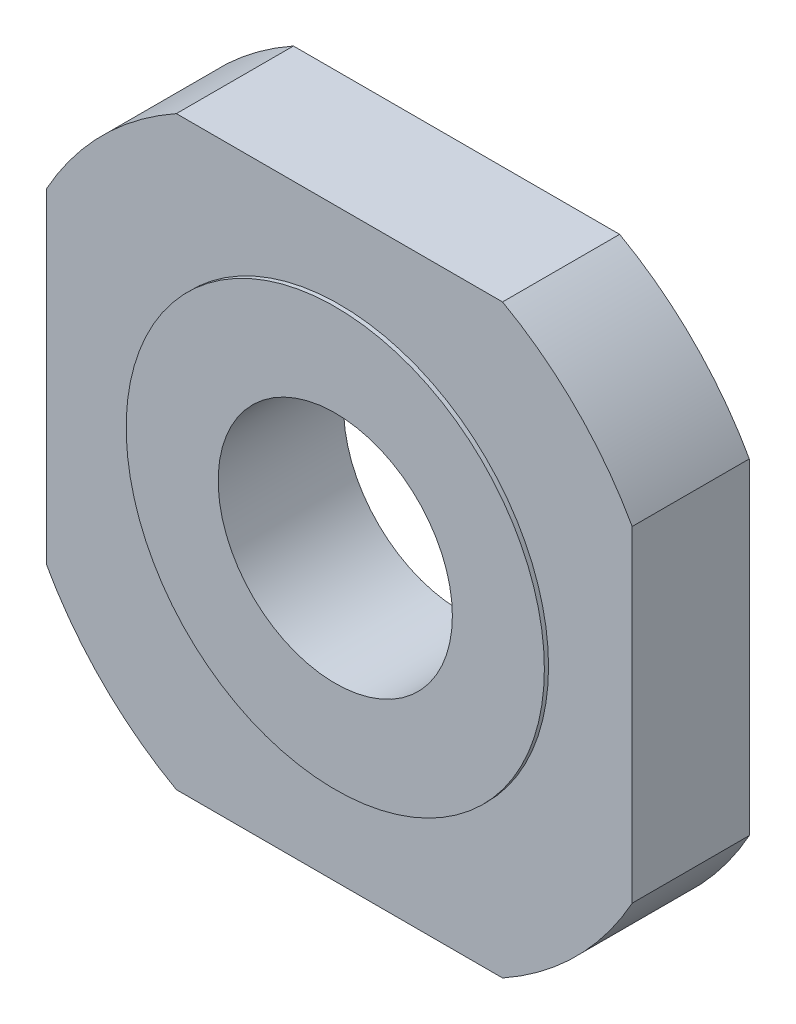
ISO-10303-21;
HEADER;
FILE_DESCRIPTION(('STEP AP214'),'2;1');
FILE_NAME('part.step','',(''),(''),'','','');
FILE_SCHEMA(('AUTOMOTIVE_DESIGN { 1 0 10303 214 1 1 1 1 }'));
ENDSEC;
DATA;
#1=APPLICATION_CONTEXT('core data for automotive mechanical design processes');
#2=APPLICATION_PROTOCOL_DEFINITION('international standard','automotive_design',2000,#1);
#3=PRODUCT_CONTEXT('',#1,'mechanical');
#4=PRODUCT('Part','Part','',(#3));
#5=PRODUCT_RELATED_PRODUCT_CATEGORY('part','',(#4));
#6=PRODUCT_DEFINITION_FORMATION('','',#4);
#7=PRODUCT_DEFINITION_CONTEXT('part definition',#1,'design');
#8=PRODUCT_DEFINITION('design','',#6,#7);
#9=PRODUCT_DEFINITION_SHAPE('','',#8);
#10=(LENGTH_UNIT() NAMED_UNIT(*) SI_UNIT(.MILLI.,.METRE.));
#11=(NAMED_UNIT(*) PLANE_ANGLE_UNIT() SI_UNIT($,.RADIAN.));
#12=(NAMED_UNIT(*) SI_UNIT($,.STERADIAN.) SOLID_ANGLE_UNIT());
#13=UNCERTAINTY_MEASURE_WITH_UNIT(LENGTH_MEASURE(1.E-05),#10,'distance_accuracy_value','');
#14=(GEOMETRIC_REPRESENTATION_CONTEXT(3) GLOBAL_UNCERTAINTY_ASSIGNED_CONTEXT((#13)) GLOBAL_UNIT_ASSIGNED_CONTEXT((#10,
#11,#12)) REPRESENTATION_CONTEXT('',''));
#15=CARTESIAN_POINT('',(0.,0.,0.));
#16=DIRECTION('',(0.,0.,1.));
#17=DIRECTION('',(1.,0.,0.));
#18=AXIS2_PLACEMENT_3D('',#15,#16,#17);
#19=CARTESIAN_POINT('',(-0.048207779633342,0.0482077796333455,7.));
#20=DIRECTION('',(0.,0.,1.));
#21=DIRECTION('',(1.,0.,0.));
#22=AXIS2_PLACEMENT_3D('',#19,#20,#21);
#23=PLANE('',#22);
#24=CARTESIAN_POINT('',(0.,0.,7.));
#25=DIRECTION('',(0.,0.,1.));
#26=DIRECTION('',(1.,0.,0.));
#27=AXIS2_PLACEMENT_3D('',#24,#25,#26);
#28=CIRCLE('',#27,25.);
#29=CARTESIAN_POINT('',(25.,0.,7.));
#30=VERTEX_POINT('',#29);
#31=EDGE_CURVE('E123',#30,#30,#28,.F.);
#32=ORIENTED_EDGE('',*,*,#31,.T.);
#33=EDGE_LOOP('',(#32));
#34=FACE_BOUND('',#33,.T.);
#35=CARTESIAN_POINT('',(-0.048207779633342,0.0482077796333455,7.));
#36=DIRECTION('',(0.,0.,1.));
#37=DIRECTION('',(1.,0.,0.));
#38=AXIS2_PLACEMENT_3D('',#35,#36,#37);
#39=CIRCLE('',#38,40.);
#40=CARTESIAN_POINT('',(-19.5,35.,7.));
#41=VERTEX_POINT('',#40);
#42=CARTESIAN_POINT('',(-35.,19.5,7.));
#43=VERTEX_POINT('',#42);
#44=EDGE_CURVE('E156',#41,#43,#39,.T.);
#45=ORIENTED_EDGE('',*,*,#44,.T.);
#46=DIRECTION('',(0.,-1.,0.));
#47=VECTOR('',#46,1.);
#48=CARTESIAN_POINT('',(-35.,-19.5,7.));
#49=LINE('',#48,#47);
#50=CARTESIAN_POINT('',(-35.,-19.5,7.));
#51=VERTEX_POINT('',#50);
#52=EDGE_CURVE('E182',#43,#51,#49,.T.);
#53=ORIENTED_EDGE('',*,*,#52,.T.);
#54=CARTESIAN_POINT('',(-0.048207779633349,-0.0482077796333559,7.));
#55=DIRECTION('',(0.,0.,1.));
#56=DIRECTION('',(1.,0.,0.));
#57=AXIS2_PLACEMENT_3D('',#54,#55,#56);
#58=CIRCLE('',#57,40.);
#59=CARTESIAN_POINT('',(-19.5,-35.,7.));
#60=VERTEX_POINT('',#59);
#61=EDGE_CURVE('E180',#51,#60,#58,.T.);
#62=ORIENTED_EDGE('',*,*,#61,.T.);
#63=DIRECTION('',(1.,0.,0.));
#64=VECTOR('',#63,1.);
#65=CARTESIAN_POINT('',(19.5,-35.,7.));
#66=LINE('',#65,#64);
#67=CARTESIAN_POINT('',(19.5,-35.,7.));
#68=VERTEX_POINT('',#67);
#69=EDGE_CURVE('E178',#60,#68,#66,.T.);
#70=ORIENTED_EDGE('',*,*,#69,.T.);
#71=CARTESIAN_POINT('',(0.048207779633349,-0.0482077796333559,7.));
#72=DIRECTION('',(0.,0.,1.));
#73=DIRECTION('',(1.,0.,0.));
#74=AXIS2_PLACEMENT_3D('',#71,#72,#73);
#75=CIRCLE('',#74,40.);
#76=CARTESIAN_POINT('',(35.,-19.5,7.));
#77=VERTEX_POINT('',#76);
#78=EDGE_CURVE('E176',#68,#77,#75,.T.);
#79=ORIENTED_EDGE('',*,*,#78,.T.);
#80=DIRECTION('',(0.,1.,0.));
#81=VECTOR('',#80,1.);
#82=CARTESIAN_POINT('',(35.,19.5,7.));
#83=LINE('',#82,#81);
#84=CARTESIAN_POINT('',(35.,19.5,7.));
#85=VERTEX_POINT('',#84);
#86=EDGE_CURVE('E174',#77,#85,#83,.T.);
#87=ORIENTED_EDGE('',*,*,#86,.T.);
#88=CARTESIAN_POINT('',(0.048207779633342,0.0482077796333455,7.));
#89=DIRECTION('',(0.,0.,1.));
#90=DIRECTION('',(-1.,0.,0.));
#91=AXIS2_PLACEMENT_3D('',#88,#89,#90);
#92=CIRCLE('',#91,40.);
#93=CARTESIAN_POINT('',(19.5,35.,7.));
#94=VERTEX_POINT('',#93);
#95=EDGE_CURVE('E172',#85,#94,#92,.T.);
#96=ORIENTED_EDGE('',*,*,#95,.T.);
#97=DIRECTION('',(-1.,0.,0.));
#98=VECTOR('',#97,1.);
#99=CARTESIAN_POINT('',(-19.5,35.,7.));
#100=LINE('',#99,#98);
#101=EDGE_CURVE('E153',#94,#41,#100,.T.);
#102=ORIENTED_EDGE('',*,*,#101,.T.);
#103=EDGE_LOOP('',(#45,#53,#62,#70,#79,#87,#96,#102));
#104=FACE_BOUND('',#103,.T.);
#105=ADVANCED_FACE('F36',(#34,#104),#23,.T.);
#106=CARTESIAN_POINT('',(-0.048207779633342,0.0482077796333455,-7.));
#107=DIRECTION('',(0.,0.,1.));
#108=DIRECTION('',(1.,0.,0.));
#109=AXIS2_PLACEMENT_3D('',#106,#107,#108);
#110=PLANE('',#109);
#111=CARTESIAN_POINT('',(0.,0.,-7.));
#112=DIRECTION('',(0.,0.,1.));
#113=DIRECTION('',(1.,0.,0.));
#114=AXIS2_PLACEMENT_3D('',#111,#112,#113);
#115=CIRCLE('',#114,25.);
#116=CARTESIAN_POINT('',(25.,0.,-7.));
#117=VERTEX_POINT('',#116);
#118=EDGE_CURVE('E11',#117,#117,#115,.F.);
#119=ORIENTED_EDGE('',*,*,#118,.F.);
#120=EDGE_LOOP('',(#119));
#121=FACE_BOUND('',#120,.T.);
#122=CARTESIAN_POINT('',(-0.048207779633342,0.0482077796333455,-7.));
#123=DIRECTION('',(0.,0.,1.));
#124=DIRECTION('',(1.,0.,0.));
#125=AXIS2_PLACEMENT_3D('',#122,#123,#124);
#126=CIRCLE('',#125,40.);
#127=CARTESIAN_POINT('',(-19.5,35.,-7.));
#128=VERTEX_POINT('',#127);
#129=CARTESIAN_POINT('',(-35.,19.5,-7.));
#130=VERTEX_POINT('',#129);
#131=EDGE_CURVE('E117',#128,#130,#126,.T.);
#132=ORIENTED_EDGE('',*,*,#131,.F.);
#133=DIRECTION('',(-1.,0.,0.));
#134=VECTOR('',#133,1.);
#135=CARTESIAN_POINT('',(-19.5,35.,-7.));
#136=LINE('',#135,#134);
#137=CARTESIAN_POINT('',(19.5,35.,-7.));
#138=VERTEX_POINT('',#137);
#139=EDGE_CURVE('E154',#138,#128,#136,.T.);
#140=ORIENTED_EDGE('',*,*,#139,.F.);
#141=CARTESIAN_POINT('',(0.048207779633342,0.0482077796333455,-7.));
#142=DIRECTION('',(0.,0.,1.));
#143=DIRECTION('',(-1.,0.,0.));
#144=AXIS2_PLACEMENT_3D('',#141,#142,#143);
#145=CIRCLE('',#144,40.);
#146=CARTESIAN_POINT('',(35.,19.5,-7.));
#147=VERTEX_POINT('',#146);
#148=EDGE_CURVE('E157',#147,#138,#145,.T.);
#149=ORIENTED_EDGE('',*,*,#148,.F.);
#150=DIRECTION('',(0.,1.,0.));
#151=VECTOR('',#150,1.);
#152=CARTESIAN_POINT('',(35.,19.5,-7.));
#153=LINE('',#152,#151);
#154=CARTESIAN_POINT('',(35.,-19.5,-7.));
#155=VERTEX_POINT('',#154);
#156=EDGE_CURVE('E159',#155,#147,#153,.T.);
#157=ORIENTED_EDGE('',*,*,#156,.F.);
#158=CARTESIAN_POINT('',(0.048207779633349,-0.0482077796333559,-7.));
#159=DIRECTION('',(0.,0.,1.));
#160=DIRECTION('',(1.,0.,0.));
#161=AXIS2_PLACEMENT_3D('',#158,#159,#160);
#162=CIRCLE('',#161,40.);
#163=CARTESIAN_POINT('',(19.5,-35.,-7.));
#164=VERTEX_POINT('',#163);
#165=EDGE_CURVE('E161',#164,#155,#162,.T.);
#166=ORIENTED_EDGE('',*,*,#165,.F.);
#167=DIRECTION('',(1.,0.,0.));
#168=VECTOR('',#167,1.);
#169=CARTESIAN_POINT('',(19.5,-35.,-7.));
#170=LINE('',#169,#168);
#171=CARTESIAN_POINT('',(-19.5,-35.,-7.));
#172=VERTEX_POINT('',#171);
#173=EDGE_CURVE('E163',#172,#164,#170,.T.);
#174=ORIENTED_EDGE('',*,*,#173,.F.);
#175=CARTESIAN_POINT('',(-0.048207779633349,-0.0482077796333559,-7.));
#176=DIRECTION('',(0.,0.,1.));
#177=DIRECTION('',(1.,0.,0.));
#178=AXIS2_PLACEMENT_3D('',#175,#176,#177);
#179=CIRCLE('',#178,40.);
#180=CARTESIAN_POINT('',(-35.,-19.5,-7.));
#181=VERTEX_POINT('',#180);
#182=EDGE_CURVE('E165',#181,#172,#179,.T.);
#183=ORIENTED_EDGE('',*,*,#182,.F.);
#184=DIRECTION('',(0.,-1.,0.));
#185=VECTOR('',#184,1.);
#186=CARTESIAN_POINT('',(-35.,-19.5,-7.));
#187=LINE('',#186,#185);
#188=EDGE_CURVE('E167',#130,#181,#187,.T.);
#189=ORIENTED_EDGE('',*,*,#188,.F.);
#190=EDGE_LOOP('',(#132,#140,#149,#157,#166,#174,#183,#189));
#191=FACE_BOUND('',#190,.T.);
#192=ADVANCED_FACE('F222',(#121,#191),#110,.F.);
#193=CARTESIAN_POINT('',(-0.048207779633342,0.0482077796333455,7.));
#194=DIRECTION('',(0.,0.,-1.));
#195=DIRECTION('',(-1.,0.,0.));
#196=AXIS2_PLACEMENT_3D('',#193,#194,#195);
#197=CYLINDRICAL_SURFACE('',#196,40.);
#198=ORIENTED_EDGE('',*,*,#131,.T.);
#199=DIRECTION('',(0.,0.,-1.));
#200=VECTOR('',#199,1.);
#201=CARTESIAN_POINT('',(-35.,19.5,7.));
#202=LINE('',#201,#200);
#203=EDGE_CURVE('E127',#43,#130,#202,.T.);
#204=ORIENTED_EDGE('',*,*,#203,.F.);
#205=ORIENTED_EDGE('',*,*,#44,.F.);
#206=DIRECTION('',(0.,0.,-1.));
#207=VECTOR('',#206,1.);
#208=CARTESIAN_POINT('',(-19.5,35.,7.));
#209=LINE('',#208,#207);
#210=EDGE_CURVE('E150',#41,#128,#209,.T.);
#211=ORIENTED_EDGE('',*,*,#210,.T.);
#212=EDGE_LOOP('',(#198,#204,#205,#211));
#213=FACE_BOUND('',#212,.T.);
#214=ADVANCED_FACE('F38',(#213),#197,.T.);
#215=CARTESIAN_POINT('',(-35.,-19.5,7.));
#216=DIRECTION('',(1.,0.,0.));
#217=DIRECTION('',(0.,0.,-1.));
#218=AXIS2_PLACEMENT_3D('',#215,#216,#217);
#219=PLANE('',#218);
#220=ORIENTED_EDGE('',*,*,#188,.T.);
#221=DIRECTION('',(0.,0.,-1.));
#222=VECTOR('',#221,1.);
#223=CARTESIAN_POINT('',(-35.,-19.5,7.));
#224=LINE('',#223,#222);
#225=EDGE_CURVE('E130',#51,#181,#224,.T.);
#226=ORIENTED_EDGE('',*,*,#225,.F.);
#227=ORIENTED_EDGE('',*,*,#52,.F.);
#228=ORIENTED_EDGE('',*,*,#203,.T.);
#229=EDGE_LOOP('',(#220,#226,#227,#228));
#230=FACE_BOUND('',#229,.T.);
#231=ADVANCED_FACE('F262',(#230),#219,.F.);
#232=CARTESIAN_POINT('',(-0.048207779633349,-0.0482077796333559,7.));
#233=DIRECTION('',(0.,0.,-1.));
#234=DIRECTION('',(-1.,0.,0.));
#235=AXIS2_PLACEMENT_3D('',#232,#233,#234);
#236=CYLINDRICAL_SURFACE('',#235,40.);
#237=ORIENTED_EDGE('',*,*,#182,.T.);
#238=DIRECTION('',(0.,0.,-1.));
#239=VECTOR('',#238,1.);
#240=CARTESIAN_POINT('',(-19.5,-35.,7.));
#241=LINE('',#240,#239);
#242=EDGE_CURVE('E135',#60,#172,#241,.T.);
#243=ORIENTED_EDGE('',*,*,#242,.F.);
#244=ORIENTED_EDGE('',*,*,#61,.F.);
#245=ORIENTED_EDGE('',*,*,#225,.T.);
#246=EDGE_LOOP('',(#237,#243,#244,#245));
#247=FACE_BOUND('',#246,.T.);
#248=ADVANCED_FACE('F259',(#247),#236,.T.);
#249=CARTESIAN_POINT('',(19.5,-35.,7.));
#250=DIRECTION('',(0.,1.,0.));
#251=DIRECTION('',(0.,0.,1.));
#252=AXIS2_PLACEMENT_3D('',#249,#250,#251);
#253=PLANE('',#252);
#254=ORIENTED_EDGE('',*,*,#173,.T.);
#255=DIRECTION('',(0.,0.,-1.));
#256=VECTOR('',#255,1.);
#257=CARTESIAN_POINT('',(19.5,-35.,7.));
#258=LINE('',#257,#256);
#259=EDGE_CURVE('E138',#68,#164,#258,.T.);
#260=ORIENTED_EDGE('',*,*,#259,.F.);
#261=ORIENTED_EDGE('',*,*,#69,.F.);
#262=ORIENTED_EDGE('',*,*,#242,.T.);
#263=EDGE_LOOP('',(#254,#260,#261,#262));
#264=FACE_BOUND('',#263,.T.);
#265=ADVANCED_FACE('F255',(#264),#253,.F.);
#266=CARTESIAN_POINT('',(0.048207779633349,-0.0482077796333559,7.));
#267=DIRECTION('',(0.,0.,-1.));
#268=DIRECTION('',(-1.,0.,0.));
#269=AXIS2_PLACEMENT_3D('',#266,#267,#268);
#270=CYLINDRICAL_SURFACE('',#269,40.);
#271=ORIENTED_EDGE('',*,*,#165,.T.);
#272=DIRECTION('',(0.,0.,-1.));
#273=VECTOR('',#272,1.);
#274=CARTESIAN_POINT('',(35.,-19.5,7.));
#275=LINE('',#274,#273);
#276=EDGE_CURVE('E141',#77,#155,#275,.T.);
#277=ORIENTED_EDGE('',*,*,#276,.F.);
#278=ORIENTED_EDGE('',*,*,#78,.F.);
#279=ORIENTED_EDGE('',*,*,#259,.T.);
#280=EDGE_LOOP('',(#271,#277,#278,#279));
#281=FACE_BOUND('',#280,.T.);
#282=ADVANCED_FACE('F251',(#281),#270,.T.);
#283=CARTESIAN_POINT('',(35.,19.5,7.));
#284=DIRECTION('',(-1.,0.,0.));
#285=DIRECTION('',(0.,0.,1.));
#286=AXIS2_PLACEMENT_3D('',#283,#284,#285);
#287=PLANE('',#286);
#288=ORIENTED_EDGE('',*,*,#156,.T.);
#289=DIRECTION('',(0.,0.,-1.));
#290=VECTOR('',#289,1.);
#291=CARTESIAN_POINT('',(35.,19.5,7.));
#292=LINE('',#291,#290);
#293=EDGE_CURVE('E144',#85,#147,#292,.T.);
#294=ORIENTED_EDGE('',*,*,#293,.F.);
#295=ORIENTED_EDGE('',*,*,#86,.F.);
#296=ORIENTED_EDGE('',*,*,#276,.T.);
#297=EDGE_LOOP('',(#288,#294,#295,#296));
#298=FACE_BOUND('',#297,.T.);
#299=ADVANCED_FACE('F247',(#298),#287,.F.);
#300=CARTESIAN_POINT('',(0.048207779633342,0.0482077796333455,7.));
#301=DIRECTION('',(0.,0.,-1.));
#302=DIRECTION('',(-1.,0.,0.));
#303=AXIS2_PLACEMENT_3D('',#300,#301,#302);
#304=CYLINDRICAL_SURFACE('',#303,40.);
#305=ORIENTED_EDGE('',*,*,#148,.T.);
#306=DIRECTION('',(0.,0.,-1.));
#307=VECTOR('',#306,1.);
#308=CARTESIAN_POINT('',(19.5,35.,7.));
#309=LINE('',#308,#307);
#310=EDGE_CURVE('E147',#94,#138,#309,.T.);
#311=ORIENTED_EDGE('',*,*,#310,.F.);
#312=ORIENTED_EDGE('',*,*,#95,.F.);
#313=ORIENTED_EDGE('',*,*,#293,.T.);
#314=EDGE_LOOP('',(#305,#311,#312,#313));
#315=FACE_BOUND('',#314,.T.);
#316=ADVANCED_FACE('F243',(#315),#304,.T.);
#317=CARTESIAN_POINT('',(-19.5,35.,7.));
#318=DIRECTION('',(0.,-1.,0.));
#319=DIRECTION('',(0.,0.,-1.));
#320=AXIS2_PLACEMENT_3D('',#317,#318,#319);
#321=PLANE('',#320);
#322=ORIENTED_EDGE('',*,*,#139,.T.);
#323=ORIENTED_EDGE('',*,*,#210,.F.);
#324=ORIENTED_EDGE('',*,*,#101,.F.);
#325=ORIENTED_EDGE('',*,*,#310,.T.);
#326=EDGE_LOOP('',(#322,#323,#324,#325));
#327=FACE_BOUND('',#326,.T.);
#328=ADVANCED_FACE('F217',(#327),#321,.F.);
#329=CARTESIAN_POINT('',(0.,0.,7.5));
#330=DIRECTION('',(0.,0.,-1.));
#331=DIRECTION('',(-1.,0.,0.));
#332=AXIS2_PLACEMENT_3D('',#329,#330,#331);
#333=CYLINDRICAL_SURFACE('',#332,25.);
#334=CARTESIAN_POINT('',(0.,0.,-7.5));
#335=DIRECTION('',(0.,0.,1.));
#336=DIRECTION('',(1.,0.,0.));
#337=AXIS2_PLACEMENT_3D('',#334,#335,#336);
#338=CIRCLE('',#337,25.);
#339=CARTESIAN_POINT('',(25.,0.,-7.5));
#340=VERTEX_POINT('',#339);
#341=EDGE_CURVE('E191',#340,#340,#338,.T.);
#342=ORIENTED_EDGE('',*,*,#341,.T.);
#343=EDGE_LOOP('',(#342));
#344=FACE_BOUND('',#343,.T.);
#345=ORIENTED_EDGE('',*,*,#118,.T.);
#346=EDGE_LOOP('',(#345));
#347=FACE_BOUND('',#346,.T.);
#348=ADVANCED_FACE('F207',(#344,#347),#333,.T.);
#349=CARTESIAN_POINT('',(0.,0.,7.5));
#350=DIRECTION('',(0.,0.,1.));
#351=DIRECTION('',(1.,0.,0.));
#352=AXIS2_PLACEMENT_3D('',#349,#350,#351);
#353=PLANE('',#352);
#354=CARTESIAN_POINT('',(0.,0.,7.5));
#355=DIRECTION('',(0.,0.,1.));
#356=DIRECTION('',(1.,0.,0.));
#357=AXIS2_PLACEMENT_3D('',#354,#355,#356);
#358=CIRCLE('',#357,25.);
#359=CARTESIAN_POINT('',(25.,0.,7.5));
#360=VERTEX_POINT('',#359);
#361=EDGE_CURVE('E190',#360,#360,#358,.T.);
#362=ORIENTED_EDGE('',*,*,#361,.T.);
#363=EDGE_LOOP('',(#362));
#364=FACE_BOUND('',#363,.T.);
#365=CARTESIAN_POINT('',(0.,0.,7.5));
#366=DIRECTION('',(0.,0.,1.));
#367=DIRECTION('',(1.,0.,0.));
#368=AXIS2_PLACEMENT_3D('',#365,#366,#367);
#369=CIRCLE('',#368,14.);
#370=CARTESIAN_POINT('',(14.,0.,7.5));
#371=VERTEX_POINT('',#370);
#372=EDGE_CURVE('E194',#371,#371,#369,.T.);
#373=ORIENTED_EDGE('',*,*,#372,.F.);
#374=EDGE_LOOP('',(#373));
#375=FACE_BOUND('',#374,.T.);
#376=ADVANCED_FACE('F204',(#364,#375),#353,.T.);
#377=CARTESIAN_POINT('',(0.,0.,-7.5));
#378=DIRECTION('',(0.,0.,1.));
#379=DIRECTION('',(1.,0.,0.));
#380=AXIS2_PLACEMENT_3D('',#377,#378,#379);
#381=PLANE('',#380);
#382=ORIENTED_EDGE('',*,*,#341,.F.);
#383=EDGE_LOOP('',(#382));
#384=FACE_BOUND('',#383,.T.);
#385=CARTESIAN_POINT('',(0.,0.,-7.5));
#386=DIRECTION('',(0.,0.,1.));
#387=DIRECTION('',(1.,0.,0.));
#388=AXIS2_PLACEMENT_3D('',#385,#386,#387);
#389=CIRCLE('',#388,14.);
#390=CARTESIAN_POINT('',(14.,0.,-7.5));
#391=VERTEX_POINT('',#390);
#392=EDGE_CURVE('E197',#391,#391,#389,.T.);
#393=ORIENTED_EDGE('',*,*,#392,.T.);
#394=EDGE_LOOP('',(#393));
#395=FACE_BOUND('',#394,.T.);
#396=ADVANCED_FACE('F206',(#384,#395),#381,.F.);
#397=ORIENTED_EDGE('',*,*,#31,.F.);
#398=EDGE_LOOP('',(#397));
#399=FACE_BOUND('',#398,.T.);
#400=ORIENTED_EDGE('',*,*,#361,.F.);
#401=EDGE_LOOP('',(#400));
#402=FACE_BOUND('',#401,.T.);
#403=ADVANCED_FACE('F214',(#399,#402),#333,.T.);
#404=CARTESIAN_POINT('',(0.,0.,7.5));
#405=DIRECTION('',(0.,0.,-1.));
#406=DIRECTION('',(-1.,0.,0.));
#407=AXIS2_PLACEMENT_3D('',#404,#405,#406);
#408=CYLINDRICAL_SURFACE('',#407,14.);
#409=CARTESIAN_POINT('',(0.,0.,7.));
#410=DIRECTION('',(0.,0.,1.));
#411=DIRECTION('',(1.,0.,0.));
#412=AXIS2_PLACEMENT_3D('',#409,#410,#411);
#413=CIRCLE('',#412,14.);
#414=CARTESIAN_POINT('',(-9.92356948158019,9.87536170194541,7.));
#415=VERTEX_POINT('',#414);
#416=CARTESIAN_POINT('',(9.87536170194685,-9.92356948157877,7.));
#417=VERTEX_POINT('',#416);
#418=EDGE_CURVE('E120',#415,#417,#413,.F.);
#419=ORIENTED_EDGE('',*,*,#418,.T.);
#420=DIRECTION('',(0.,0.,-1.));
#421=VECTOR('',#420,1.);
#422=CARTESIAN_POINT('',(9.87536170194684,-9.92356948157877,0.));
#423=LINE('',#422,#421);
#424=CARTESIAN_POINT('',(9.87536170194685,-9.92356948157877,-7.));
#425=VERTEX_POINT('',#424);
#426=EDGE_CURVE('E44',#417,#425,#423,.T.);
#427=ORIENTED_EDGE('',*,*,#426,.T.);
#428=CARTESIAN_POINT('',(0.,0.,-7.));
#429=DIRECTION('',(0.,0.,1.));
#430=DIRECTION('',(1.,0.,0.));
#431=AXIS2_PLACEMENT_3D('',#428,#429,#430);
#432=CIRCLE('',#431,14.);
#433=CARTESIAN_POINT('',(-9.92356948158019,9.87536170194541,-7.));
#434=VERTEX_POINT('',#433);
#435=EDGE_CURVE('E50',#434,#425,#432,.F.);
#436=ORIENTED_EDGE('',*,*,#435,.F.);
#437=DIRECTION('',(0.,0.,-1.));
#438=VECTOR('',#437,1.);
#439=CARTESIAN_POINT('',(-9.92356948158019,9.87536170194541,0.));
#440=LINE('',#439,#438);
#441=EDGE_CURVE('E57',#434,#415,#440,.F.);
#442=ORIENTED_EDGE('',*,*,#441,.T.);
#443=EDGE_LOOP('',(#419,#427,#436,#442));
#444=FACE_BOUND('',#443,.T.);
#445=ORIENTED_EDGE('',*,*,#372,.T.);
#446=EDGE_LOOP('',(#445));
#447=FACE_BOUND('',#446,.T.);
#448=ORIENTED_EDGE('',*,*,#392,.F.);
#449=EDGE_LOOP('',(#448));
#450=FACE_BOUND('',#449,.T.);
#451=ADVANCED_FACE('F125',(#444,#447,#450),#408,.F.);
#452=CARTESIAN_POINT('',(-0.048207779633349,-0.0482077796333559,7.));
#453=DIRECTION('',(0.,0.,-1.));
#454=DIRECTION('',(-1.,0.,0.));
#455=AXIS2_PLACEMENT_3D('',#452,#453,#454);
#456=CYLINDRICAL_SURFACE('',#455,14.);
#457=ORIENTED_EDGE('',*,*,#426,.F.);
#458=CARTESIAN_POINT('',(-0.048207779633349,-0.0482077796333559,7.));
#459=DIRECTION('',(0.,0.,1.));
#460=DIRECTION('',(1.,0.,0.));
#461=AXIS2_PLACEMENT_3D('',#458,#459,#460);
#462=CIRCLE('',#461,14.);
#463=EDGE_CURVE('E111',#417,#415,#462,.T.);
#464=ORIENTED_EDGE('',*,*,#463,.T.);
#465=ORIENTED_EDGE('',*,*,#441,.F.);
#466=CARTESIAN_POINT('',(-0.048207779633349,-0.0482077796333559,-7.));
#467=DIRECTION('',(0.,0.,1.));
#468=DIRECTION('',(1.,0.,0.));
#469=AXIS2_PLACEMENT_3D('',#466,#467,#468);
#470=CIRCLE('',#469,14.);
#471=EDGE_CURVE('E118',#425,#434,#470,.T.);
#472=ORIENTED_EDGE('',*,*,#471,.F.);
#473=EDGE_LOOP('',(#457,#464,#465,#472));
#474=FACE_BOUND('',#473,.T.);
#475=ADVANCED_FACE('F113',(#474),#456,.F.);
#476=ORIENTED_EDGE('',*,*,#471,.T.);
#477=ORIENTED_EDGE('',*,*,#435,.T.);
#478=EDGE_LOOP('',(#476,#477));
#479=FACE_BOUND('',#478,.T.);
#480=ADVANCED_FACE('F230',(#479),#110,.F.);
#481=ORIENTED_EDGE('',*,*,#418,.F.);
#482=ORIENTED_EDGE('',*,*,#463,.F.);
#483=EDGE_LOOP('',(#481,#482));
#484=FACE_BOUND('',#483,.T.);
#485=ADVANCED_FACE('F121',(#484),#23,.T.);
#486=CLOSED_SHELL('',(#105,#192,#214,#231,#248,#265,#282,#299,#316,#328,#348,#376,#396,#403,
#451,#475,#480,#485));
#487=MANIFOLD_SOLID_BREP('B2',#486);
#488=ADVANCED_BREP_SHAPE_REPRESENTATION('',(#18,#487),#14);
#489=SHAPE_DEFINITION_REPRESENTATION(#9,#488);
ENDSEC;
END-ISO-10303-21;
